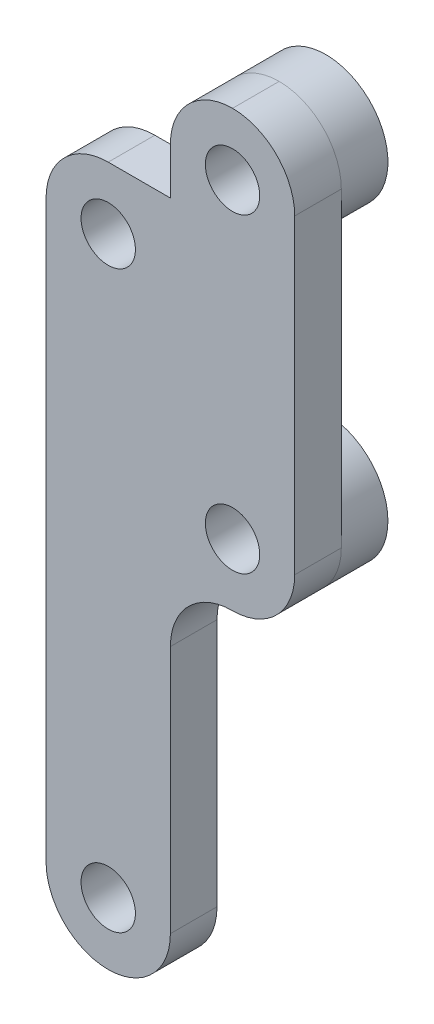
ISO-10303-21;
HEADER;
FILE_DESCRIPTION(('STEP AP214'),'2;1');
FILE_NAME('part.step','',(''),(''),'','','');
FILE_SCHEMA(('AUTOMOTIVE_DESIGN { 1 0 10303 214 1 1 1 1 }'));
ENDSEC;
DATA;
#1=APPLICATION_CONTEXT('core data for automotive mechanical design processes');
#2=APPLICATION_PROTOCOL_DEFINITION('international standard','automotive_design',2000,#1);
#3=PRODUCT_CONTEXT('',#1,'mechanical');
#4=PRODUCT('Part','Part','',(#3));
#5=PRODUCT_RELATED_PRODUCT_CATEGORY('part','',(#4));
#6=PRODUCT_DEFINITION_FORMATION('','',#4);
#7=PRODUCT_DEFINITION_CONTEXT('part definition',#1,'design');
#8=PRODUCT_DEFINITION('design','',#6,#7);
#9=PRODUCT_DEFINITION_SHAPE('','',#8);
#10=(LENGTH_UNIT() NAMED_UNIT(*) SI_UNIT(.MILLI.,.METRE.));
#11=(NAMED_UNIT(*) PLANE_ANGLE_UNIT() SI_UNIT($,.RADIAN.));
#12=(NAMED_UNIT(*) SI_UNIT($,.STERADIAN.) SOLID_ANGLE_UNIT());
#13=UNCERTAINTY_MEASURE_WITH_UNIT(LENGTH_MEASURE(1.E-05),#10,'distance_accuracy_value','');
#14=(GEOMETRIC_REPRESENTATION_CONTEXT(3) GLOBAL_UNCERTAINTY_ASSIGNED_CONTEXT((#13)) GLOBAL_UNIT_ASSIGNED_CONTEXT((#10,
#11,#12)) REPRESENTATION_CONTEXT('',''));
#15=CARTESIAN_POINT('',(0.,0.,0.));
#16=DIRECTION('',(0.,0.,1.));
#17=DIRECTION('',(1.,0.,0.));
#18=AXIS2_PLACEMENT_3D('',#15,#16,#17);
#19=CARTESIAN_POINT('',(0.,0.,0.));
#20=DIRECTION('',(0.,0.,-1.));
#21=DIRECTION('',(-1.,0.,0.));
#22=AXIS2_PLACEMENT_3D('',#19,#20,#21);
#23=PLANE('',#22);
#24=CARTESIAN_POINT('',(-8.,13.,0.));
#25=DIRECTION('',(0.,0.,1.));
#26=DIRECTION('',(1.,0.,0.));
#27=AXIS2_PLACEMENT_3D('',#24,#25,#26);
#28=CIRCLE('',#27,1.75);
#29=CARTESIAN_POINT('',(-6.25,13.,0.));
#30=VERTEX_POINT('',#29);
#31=EDGE_CURVE('E179',#30,#30,#28,.T.);
#32=ORIENTED_EDGE('',*,*,#31,.T.);
#33=EDGE_LOOP('',(#32));
#34=FACE_BOUND('',#33,.T.);
#35=CARTESIAN_POINT('',(-8.,-24.,0.));
#36=DIRECTION('',(0.,0.,1.));
#37=DIRECTION('',(1.,0.,0.));
#38=AXIS2_PLACEMENT_3D('',#35,#36,#37);
#39=CIRCLE('',#38,1.75);
#40=CARTESIAN_POINT('',(-6.25,-24.,0.));
#41=VERTEX_POINT('',#40);
#42=EDGE_CURVE('E183',#41,#41,#39,.T.);
#43=ORIENTED_EDGE('',*,*,#42,.T.);
#44=EDGE_LOOP('',(#43));
#45=FACE_BOUND('',#44,.T.);
#46=CARTESIAN_POINT('',(-8.,-24.,0.));
#47=DIRECTION('',(0.,0.,-1.));
#48=DIRECTION('',(-1.,0.,0.));
#49=AXIS2_PLACEMENT_3D('',#46,#47,#48);
#50=CIRCLE('',#49,4.);
#51=CARTESIAN_POINT('',(-4.,-24.,0.));
#52=VERTEX_POINT('',#51);
#53=CARTESIAN_POINT('',(-8.,-28.,0.));
#54=VERTEX_POINT('',#53);
#55=EDGE_CURVE('E215',#52,#54,#50,.T.);
#56=ORIENTED_EDGE('',*,*,#55,.T.);
#57=CARTESIAN_POINT('',(-8.,-24.,0.));
#58=DIRECTION('',(0.,0.,-1.));
#59=DIRECTION('',(-1.,0.,0.));
#60=AXIS2_PLACEMENT_3D('',#57,#58,#59);
#61=CIRCLE('',#60,4.);
#62=CARTESIAN_POINT('',(-12.,-24.,0.));
#63=VERTEX_POINT('',#62);
#64=EDGE_CURVE('E217',#54,#63,#61,.T.);
#65=ORIENTED_EDGE('',*,*,#64,.T.);
#66=DIRECTION('',(0.,-1.,0.));
#67=VECTOR('',#66,1.);
#68=CARTESIAN_POINT('',(-12.,-28.,0.));
#69=LINE('',#68,#67);
#70=CARTESIAN_POINT('',(-12.,13.,0.));
#71=VERTEX_POINT('',#70);
#72=EDGE_CURVE('E194',#71,#63,#69,.T.);
#73=ORIENTED_EDGE('',*,*,#72,.F.);
#74=CARTESIAN_POINT('',(-8.,13.,0.));
#75=DIRECTION('',(0.,0.,-1.));
#76=DIRECTION('',(-1.,0.,0.));
#77=AXIS2_PLACEMENT_3D('',#74,#75,#76);
#78=CIRCLE('',#77,4.);
#79=CARTESIAN_POINT('',(-8.,17.,0.));
#80=VERTEX_POINT('',#79);
#81=EDGE_CURVE('E213',#71,#80,#78,.T.);
#82=ORIENTED_EDGE('',*,*,#81,.T.);
#83=DIRECTION('',(-1.,0.,0.));
#84=VECTOR('',#83,1.);
#85=CARTESIAN_POINT('',(-12.,17.,0.));
#86=LINE('',#85,#84);
#87=CARTESIAN_POINT('',(-4.,17.,0.));
#88=VERTEX_POINT('',#87);
#89=EDGE_CURVE('E207',#88,#80,#86,.T.);
#90=ORIENTED_EDGE('',*,*,#89,.F.);
#91=DIRECTION('',(0.,-1.,0.));
#92=VECTOR('',#91,1.);
#93=CARTESIAN_POINT('',(-4.,24.,0.));
#94=LINE('',#93,#92);
#95=CARTESIAN_POINT('',(-4.,20.,0.));
#96=VERTEX_POINT('',#95);
#97=EDGE_CURVE('E152',#96,#88,#94,.T.);
#98=ORIENTED_EDGE('',*,*,#97,.F.);
#99=CARTESIAN_POINT('',(0.,20.,0.));
#100=DIRECTION('',(0.,0.,-1.));
#101=DIRECTION('',(-1.,0.,0.));
#102=AXIS2_PLACEMENT_3D('',#99,#100,#101);
#103=CIRCLE('',#102,4.);
#104=CARTESIAN_POINT('',(4.,20.,0.));
#105=VERTEX_POINT('',#104);
#106=EDGE_CURVE('E150',#105,#96,#103,.T.);
#107=ORIENTED_EDGE('',*,*,#106,.F.);
#108=DIRECTION('',(0.,1.,0.));
#109=VECTOR('',#108,1.);
#110=CARTESIAN_POINT('',(4.,24.,0.));
#111=LINE('',#110,#109);
#112=CARTESIAN_POINT('',(4.,0.,0.));
#113=VERTEX_POINT('',#112);
#114=EDGE_CURVE('E130',#113,#105,#111,.T.);
#115=ORIENTED_EDGE('',*,*,#114,.F.);
#116=CARTESIAN_POINT('',(0.,0.,0.));
#117=DIRECTION('',(0.,0.,-1.));
#118=DIRECTION('',(-1.,0.,0.));
#119=AXIS2_PLACEMENT_3D('',#116,#117,#118);
#120=CIRCLE('',#119,4.);
#121=CARTESIAN_POINT('',(0.,-4.,0.));
#122=VERTEX_POINT('',#121);
#123=EDGE_CURVE('E141',#122,#113,#120,.T.);
#124=ORIENTED_EDGE('',*,*,#123,.F.);
#125=CARTESIAN_POINT('',(0.,-8.,0.));
#126=DIRECTION('',(0.,0.,-1.));
#127=DIRECTION('',(-1.,0.,0.));
#128=AXIS2_PLACEMENT_3D('',#125,#126,#127);
#129=CIRCLE('',#128,4.);
#130=CARTESIAN_POINT('',(-4.,-8.,0.));
#131=VERTEX_POINT('',#130);
#132=EDGE_CURVE('E42',#122,#131,#129,.F.);
#133=ORIENTED_EDGE('',*,*,#132,.T.);
#134=DIRECTION('',(0.,1.,0.));
#135=VECTOR('',#134,1.);
#136=CARTESIAN_POINT('',(-4.,-28.,0.));
#137=LINE('',#136,#135);
#138=EDGE_CURVE('E153',#52,#131,#137,.T.);
#139=ORIENTED_EDGE('',*,*,#138,.F.);
#140=EDGE_LOOP('',(#56,#65,#73,#82,#90,#98,#107,#115,#124,#133,#139));
#141=FACE_BOUND('',#140,.T.);
#142=ADVANCED_FACE('F33',(#34,#45,#141),#23,.T.);
#143=CARTESIAN_POINT('',(0.,0.,3.));
#144=DIRECTION('',(0.,0.,-1.));
#145=DIRECTION('',(-1.,0.,0.));
#146=AXIS2_PLACEMENT_3D('',#143,#144,#145);
#147=PLANE('',#146);
#148=DIRECTION('',(0.,-1.,0.));
#149=VECTOR('',#148,1.);
#150=CARTESIAN_POINT('',(-12.,-28.,3.));
#151=LINE('',#150,#149);
#152=CARTESIAN_POINT('',(-12.,13.,3.));
#153=VERTEX_POINT('',#152);
#154=CARTESIAN_POINT('',(-12.,-24.,3.));
#155=VERTEX_POINT('',#154);
#156=EDGE_CURVE('E200',#153,#155,#151,.T.);
#157=ORIENTED_EDGE('',*,*,#156,.T.);
#158=CARTESIAN_POINT('',(-8.,-24.,3.));
#159=DIRECTION('',(0.,0.,-1.));
#160=DIRECTION('',(-1.,0.,0.));
#161=AXIS2_PLACEMENT_3D('',#158,#159,#160);
#162=CIRCLE('',#161,4.);
#163=CARTESIAN_POINT('',(-8.,-28.,3.));
#164=VERTEX_POINT('',#163);
#165=EDGE_CURVE('E234',#155,#164,#162,.F.);
#166=ORIENTED_EDGE('',*,*,#165,.T.);
#167=CARTESIAN_POINT('',(-8.,-24.,3.));
#168=DIRECTION('',(0.,0.,-1.));
#169=DIRECTION('',(-1.,0.,0.));
#170=AXIS2_PLACEMENT_3D('',#167,#168,#169);
#171=CIRCLE('',#170,4.);
#172=CARTESIAN_POINT('',(-4.,-24.,3.));
#173=VERTEX_POINT('',#172);
#174=EDGE_CURVE('E232',#164,#173,#171,.F.);
#175=ORIENTED_EDGE('',*,*,#174,.T.);
#176=DIRECTION('',(0.,1.,0.));
#177=VECTOR('',#176,1.);
#178=CARTESIAN_POINT('',(-4.,-28.,3.));
#179=LINE('',#178,#177);
#180=CARTESIAN_POINT('',(-4.,-8.,3.));
#181=VERTEX_POINT('',#180);
#182=EDGE_CURVE('E191',#173,#181,#179,.T.);
#183=ORIENTED_EDGE('',*,*,#182,.T.);
#184=CARTESIAN_POINT('',(0.,-8.,3.));
#185=DIRECTION('',(0.,0.,-1.));
#186=DIRECTION('',(-1.,0.,0.));
#187=AXIS2_PLACEMENT_3D('',#184,#185,#186);
#188=CIRCLE('',#187,4.);
#189=CARTESIAN_POINT('',(0.,-4.,3.));
#190=VERTEX_POINT('',#189);
#191=EDGE_CURVE('E11',#181,#190,#188,.T.);
#192=ORIENTED_EDGE('',*,*,#191,.T.);
#193=CARTESIAN_POINT('',(0.,0.,3.));
#194=DIRECTION('',(0.,0.,-1.));
#195=DIRECTION('',(-1.,0.,0.));
#196=AXIS2_PLACEMENT_3D('',#193,#194,#195);
#197=CIRCLE('',#196,4.);
#198=CARTESIAN_POINT('',(4.,0.,3.));
#199=VERTEX_POINT('',#198);
#200=EDGE_CURVE('E230',#190,#199,#197,.F.);
#201=ORIENTED_EDGE('',*,*,#200,.T.);
#202=DIRECTION('',(0.,1.,0.));
#203=VECTOR('',#202,1.);
#204=CARTESIAN_POINT('',(4.,24.,3.));
#205=LINE('',#204,#203);
#206=CARTESIAN_POINT('',(4.,20.,3.));
#207=VERTEX_POINT('',#206);
#208=EDGE_CURVE('E133',#199,#207,#205,.T.);
#209=ORIENTED_EDGE('',*,*,#208,.T.);
#210=CARTESIAN_POINT('',(0.,20.,3.));
#211=DIRECTION('',(0.,0.,-1.));
#212=DIRECTION('',(-1.,0.,0.));
#213=AXIS2_PLACEMENT_3D('',#210,#211,#212);
#214=CIRCLE('',#213,4.);
#215=CARTESIAN_POINT('',(0.,24.,3.));
#216=VERTEX_POINT('',#215);
#217=EDGE_CURVE('E226',#207,#216,#214,.F.);
#218=ORIENTED_EDGE('',*,*,#217,.T.);
#219=CARTESIAN_POINT('',(0.,20.,3.));
#220=DIRECTION('',(0.,0.,-1.));
#221=DIRECTION('',(-1.,0.,0.));
#222=AXIS2_PLACEMENT_3D('',#219,#220,#221);
#223=CIRCLE('',#222,4.);
#224=CARTESIAN_POINT('',(-4.,20.,3.));
#225=VERTEX_POINT('',#224);
#226=EDGE_CURVE('E58',#216,#225,#223,.F.);
#227=ORIENTED_EDGE('',*,*,#226,.T.);
#228=DIRECTION('',(0.,-1.,0.));
#229=VECTOR('',#228,1.);
#230=CARTESIAN_POINT('',(-4.,24.,3.));
#231=LINE('',#230,#229);
#232=CARTESIAN_POINT('',(-4.,17.,3.));
#233=VERTEX_POINT('',#232);
#234=EDGE_CURVE('E196',#225,#233,#231,.T.);
#235=ORIENTED_EDGE('',*,*,#234,.T.);
#236=DIRECTION('',(-1.,0.,0.));
#237=VECTOR('',#236,1.);
#238=CARTESIAN_POINT('',(-12.,17.,3.));
#239=LINE('',#238,#237);
#240=CARTESIAN_POINT('',(-8.,17.,3.));
#241=VERTEX_POINT('',#240);
#242=EDGE_CURVE('E198',#233,#241,#239,.T.);
#243=ORIENTED_EDGE('',*,*,#242,.T.);
#244=CARTESIAN_POINT('',(-8.,13.,3.));
#245=DIRECTION('',(0.,0.,-1.));
#246=DIRECTION('',(-1.,0.,0.));
#247=AXIS2_PLACEMENT_3D('',#244,#245,#246);
#248=CIRCLE('',#247,4.);
#249=EDGE_CURVE('E228',#241,#153,#248,.F.);
#250=ORIENTED_EDGE('',*,*,#249,.T.);
#251=EDGE_LOOP('',(#157,#166,#175,#183,#192,#201,#209,#218,#227,#235,#243,#250));
#252=FACE_BOUND('',#251,.T.);
#253=CARTESIAN_POINT('',(-8.,-24.,3.));
#254=DIRECTION('',(0.,0.,1.));
#255=DIRECTION('',(1.,0.,0.));
#256=AXIS2_PLACEMENT_3D('',#253,#254,#255);
#257=CIRCLE('',#256,1.75);
#258=CARTESIAN_POINT('',(-6.25,-24.,3.));
#259=VERTEX_POINT('',#258);
#260=EDGE_CURVE('E186',#259,#259,#257,.T.);
#261=ORIENTED_EDGE('',*,*,#260,.F.);
#262=EDGE_LOOP('',(#261));
#263=FACE_BOUND('',#262,.T.);
#264=CARTESIAN_POINT('',(-8.,13.,3.));
#265=DIRECTION('',(0.,0.,1.));
#266=DIRECTION('',(1.,0.,0.));
#267=AXIS2_PLACEMENT_3D('',#264,#265,#266);
#268=CIRCLE('',#267,1.75);
#269=CARTESIAN_POINT('',(-6.25,13.,3.));
#270=VERTEX_POINT('',#269);
#271=EDGE_CURVE('E180',#270,#270,#268,.T.);
#272=ORIENTED_EDGE('',*,*,#271,.F.);
#273=EDGE_LOOP('',(#272));
#274=FACE_BOUND('',#273,.T.);
#275=CARTESIAN_POINT('',(0.,20.,3.));
#276=DIRECTION('',(0.,0.,1.));
#277=DIRECTION('',(1.,0.,0.));
#278=AXIS2_PLACEMENT_3D('',#275,#276,#277);
#279=CIRCLE('',#278,1.75);
#280=CARTESIAN_POINT('',(1.75,20.,3.));
#281=VERTEX_POINT('',#280);
#282=EDGE_CURVE('E176',#281,#281,#279,.T.);
#283=ORIENTED_EDGE('',*,*,#282,.F.);
#284=EDGE_LOOP('',(#283));
#285=FACE_BOUND('',#284,.T.);
#286=CARTESIAN_POINT('',(0.,0.,3.));
#287=DIRECTION('',(0.,0.,1.));
#288=DIRECTION('',(1.,0.,0.));
#289=AXIS2_PLACEMENT_3D('',#286,#287,#288);
#290=CIRCLE('',#289,1.75);
#291=CARTESIAN_POINT('',(1.75,0.,3.));
#292=VERTEX_POINT('',#291);
#293=EDGE_CURVE('E171',#292,#292,#290,.T.);
#294=ORIENTED_EDGE('',*,*,#293,.F.);
#295=EDGE_LOOP('',(#294));
#296=FACE_BOUND('',#295,.T.);
#297=ADVANCED_FACE('F264',(#252,#263,#274,#285,#296),#147,.F.);
#298=CARTESIAN_POINT('',(-4.,-28.,3.));
#299=DIRECTION('',(-1.,0.,0.));
#300=DIRECTION('',(0.,0.,1.));
#301=AXIS2_PLACEMENT_3D('',#298,#299,#300);
#302=PLANE('',#301);
#303=ORIENTED_EDGE('',*,*,#182,.F.);
#304=DIRECTION('',(0.,0.,-1.));
#305=VECTOR('',#304,1.);
#306=CARTESIAN_POINT('',(-4.,-24.,3.));
#307=LINE('',#306,#305);
#308=EDGE_CURVE('E239',#173,#52,#307,.T.);
#309=ORIENTED_EDGE('',*,*,#308,.T.);
#310=ORIENTED_EDGE('',*,*,#138,.T.);
#311=DIRECTION('',(0.,0.,-1.));
#312=VECTOR('',#311,1.);
#313=CARTESIAN_POINT('',(-4.,-8.,3.));
#314=LINE('',#313,#312);
#315=EDGE_CURVE('E236',#131,#181,#314,.F.);
#316=ORIENTED_EDGE('',*,*,#315,.T.);
#317=EDGE_LOOP('',(#303,#309,#310,#316));
#318=FACE_BOUND('',#317,.T.);
#319=ADVANCED_FACE('F270',(#318),#302,.F.);
#320=CARTESIAN_POINT('',(4.,24.,3.));
#321=DIRECTION('',(-1.,0.,0.));
#322=DIRECTION('',(0.,-1.,0.));
#323=AXIS2_PLACEMENT_3D('',#320,#321,#322);
#324=PLANE('',#323);
#325=ORIENTED_EDGE('',*,*,#208,.F.);
#326=DIRECTION('',(0.,0.,-1.));
#327=VECTOR('',#326,1.);
#328=CARTESIAN_POINT('',(4.,0.,3.));
#329=LINE('',#328,#327);
#330=EDGE_CURVE('E125',#199,#113,#329,.T.);
#331=ORIENTED_EDGE('',*,*,#330,.T.);
#332=ORIENTED_EDGE('',*,*,#114,.T.);
#333=DIRECTION('',(0.,0.,-1.));
#334=VECTOR('',#333,1.);
#335=CARTESIAN_POINT('',(4.,20.,3.));
#336=LINE('',#335,#334);
#337=EDGE_CURVE('E137',#105,#207,#336,.F.);
#338=ORIENTED_EDGE('',*,*,#337,.T.);
#339=EDGE_LOOP('',(#325,#331,#332,#338));
#340=FACE_BOUND('',#339,.T.);
#341=ADVANCED_FACE('F127',(#340),#324,.F.);
#342=CARTESIAN_POINT('',(-4.,24.,3.));
#343=DIRECTION('',(1.,0.,0.));
#344=DIRECTION('',(0.,0.,-1.));
#345=AXIS2_PLACEMENT_3D('',#342,#343,#344);
#346=PLANE('',#345);
#347=ORIENTED_EDGE('',*,*,#234,.F.);
#348=DIRECTION('',(0.,0.,-1.));
#349=VECTOR('',#348,1.);
#350=CARTESIAN_POINT('',(-4.,20.,3.));
#351=LINE('',#350,#349);
#352=EDGE_CURVE('E243',#225,#96,#351,.T.);
#353=ORIENTED_EDGE('',*,*,#352,.T.);
#354=ORIENTED_EDGE('',*,*,#97,.T.);
#355=DIRECTION('',(0.,0.,-1.));
#356=VECTOR('',#355,1.);
#357=CARTESIAN_POINT('',(-4.,17.,3.));
#358=LINE('',#357,#356);
#359=EDGE_CURVE('E203',#233,#88,#358,.T.);
#360=ORIENTED_EDGE('',*,*,#359,.F.);
#361=EDGE_LOOP('',(#347,#353,#354,#360));
#362=FACE_BOUND('',#361,.T.);
#363=ADVANCED_FACE('F259',(#362),#346,.F.);
#364=CARTESIAN_POINT('',(-12.,17.,3.));
#365=DIRECTION('',(0.,-1.,0.));
#366=DIRECTION('',(0.,0.,-1.));
#367=AXIS2_PLACEMENT_3D('',#364,#365,#366);
#368=PLANE('',#367);
#369=ORIENTED_EDGE('',*,*,#89,.T.);
#370=DIRECTION('',(0.,0.,-1.));
#371=VECTOR('',#370,1.);
#372=CARTESIAN_POINT('',(-8.,17.,3.));
#373=LINE('',#372,#371);
#374=EDGE_CURVE('E50',#80,#241,#373,.F.);
#375=ORIENTED_EDGE('',*,*,#374,.T.);
#376=ORIENTED_EDGE('',*,*,#242,.F.);
#377=ORIENTED_EDGE('',*,*,#359,.T.);
#378=EDGE_LOOP('',(#369,#375,#376,#377));
#379=FACE_BOUND('',#378,.T.);
#380=ADVANCED_FACE('F290',(#379),#368,.F.);
#381=CARTESIAN_POINT('',(-12.,-28.,3.));
#382=DIRECTION('',(1.,0.,0.));
#383=DIRECTION('',(0.,0.,-1.));
#384=AXIS2_PLACEMENT_3D('',#381,#382,#383);
#385=PLANE('',#384);
#386=ORIENTED_EDGE('',*,*,#72,.T.);
#387=DIRECTION('',(0.,0.,-1.));
#388=VECTOR('',#387,1.);
#389=CARTESIAN_POINT('',(-12.,-24.,3.));
#390=LINE('',#389,#388);
#391=EDGE_CURVE('E222',#63,#155,#390,.F.);
#392=ORIENTED_EDGE('',*,*,#391,.T.);
#393=ORIENTED_EDGE('',*,*,#156,.F.);
#394=DIRECTION('',(0.,0.,-1.));
#395=VECTOR('',#394,1.);
#396=CARTESIAN_POINT('',(-12.,13.,3.));
#397=LINE('',#396,#395);
#398=EDGE_CURVE('E219',#153,#71,#397,.T.);
#399=ORIENTED_EDGE('',*,*,#398,.T.);
#400=EDGE_LOOP('',(#386,#392,#393,#399));
#401=FACE_BOUND('',#400,.T.);
#402=ADVANCED_FACE('F284',(#401),#385,.F.);
#403=CARTESIAN_POINT('',(-8.,-24.,3.));
#404=DIRECTION('',(0.,0.,-1.));
#405=DIRECTION('',(-1.,0.,0.));
#406=AXIS2_PLACEMENT_3D('',#403,#404,#405);
#407=CYLINDRICAL_SURFACE('',#406,1.75);
#408=ORIENTED_EDGE('',*,*,#260,.T.);
#409=EDGE_LOOP('',(#408));
#410=FACE_BOUND('',#409,.T.);
#411=ORIENTED_EDGE('',*,*,#42,.F.);
#412=EDGE_LOOP('',(#411));
#413=FACE_BOUND('',#412,.T.);
#414=ADVANCED_FACE('F297',(#410,#413),#407,.F.);
#415=CARTESIAN_POINT('',(-8.,13.,3.));
#416=DIRECTION('',(0.,0.,-1.));
#417=DIRECTION('',(-1.,0.,0.));
#418=AXIS2_PLACEMENT_3D('',#415,#416,#417);
#419=CYLINDRICAL_SURFACE('',#418,1.75);
#420=ORIENTED_EDGE('',*,*,#271,.T.);
#421=EDGE_LOOP('',(#420));
#422=FACE_BOUND('',#421,.T.);
#423=ORIENTED_EDGE('',*,*,#31,.F.);
#424=EDGE_LOOP('',(#423));
#425=FACE_BOUND('',#424,.T.);
#426=ADVANCED_FACE('F311',(#422,#425),#419,.F.);
#427=CARTESIAN_POINT('',(0.,20.,3.));
#428=DIRECTION('',(0.,0.,-1.));
#429=DIRECTION('',(-1.,0.,0.));
#430=AXIS2_PLACEMENT_3D('',#427,#428,#429);
#431=CYLINDRICAL_SURFACE('',#430,1.75);
#432=ORIENTED_EDGE('',*,*,#282,.T.);
#433=EDGE_LOOP('',(#432));
#434=FACE_BOUND('',#433,.T.);
#435=CARTESIAN_POINT('',(0.,20.,-3.));
#436=DIRECTION('',(0.,0.,-1.));
#437=DIRECTION('',(-1.,0.,0.));
#438=AXIS2_PLACEMENT_3D('',#435,#436,#437);
#439=CIRCLE('',#438,1.75);
#440=CARTESIAN_POINT('',(-1.75,20.,-3.));
#441=VERTEX_POINT('',#440);
#442=EDGE_CURVE('E161',#441,#441,#439,.T.);
#443=ORIENTED_EDGE('',*,*,#442,.T.);
#444=EDGE_LOOP('',(#443));
#445=FACE_BOUND('',#444,.T.);
#446=ADVANCED_FACE('F315',(#434,#445),#431,.F.);
#447=CARTESIAN_POINT('',(0.,0.,3.));
#448=DIRECTION('',(0.,0.,-1.));
#449=DIRECTION('',(-1.,0.,0.));
#450=AXIS2_PLACEMENT_3D('',#447,#448,#449);
#451=CYLINDRICAL_SURFACE('',#450,1.75);
#452=ORIENTED_EDGE('',*,*,#293,.T.);
#453=EDGE_LOOP('',(#452));
#454=FACE_BOUND('',#453,.T.);
#455=CARTESIAN_POINT('',(0.,0.,-3.));
#456=DIRECTION('',(0.,0.,-1.));
#457=DIRECTION('',(-1.,0.,0.));
#458=AXIS2_PLACEMENT_3D('',#455,#456,#457);
#459=CIRCLE('',#458,1.75);
#460=CARTESIAN_POINT('',(-1.75,0.,-3.));
#461=VERTEX_POINT('',#460);
#462=EDGE_CURVE('E146',#461,#461,#459,.T.);
#463=ORIENTED_EDGE('',*,*,#462,.T.);
#464=EDGE_LOOP('',(#463));
#465=FACE_BOUND('',#464,.T.);
#466=ADVANCED_FACE('F319',(#454,#465),#451,.F.);
#467=CARTESIAN_POINT('',(0.,20.,-3.));
#468=DIRECTION('',(0.,0.,-1.));
#469=DIRECTION('',(-1.,0.,0.));
#470=AXIS2_PLACEMENT_3D('',#467,#468,#469);
#471=PLANE('',#470);
#472=CARTESIAN_POINT('',(0.,20.,-3.));
#473=DIRECTION('',(0.,0.,-1.));
#474=DIRECTION('',(-1.,0.,0.));
#475=AXIS2_PLACEMENT_3D('',#472,#473,#474);
#476=CIRCLE('',#475,4.);
#477=CARTESIAN_POINT('',(-4.,20.,-3.));
#478=VERTEX_POINT('',#477);
#479=EDGE_CURVE('E168',#478,#478,#476,.T.);
#480=ORIENTED_EDGE('',*,*,#479,.T.);
#481=EDGE_LOOP('',(#480));
#482=FACE_BOUND('',#481,.T.);
#483=ORIENTED_EDGE('',*,*,#442,.F.);
#484=EDGE_LOOP('',(#483));
#485=FACE_BOUND('',#484,.T.);
#486=ADVANCED_FACE('F323',(#482,#485),#471,.T.);
#487=CARTESIAN_POINT('',(0.,20.,-3.));
#488=DIRECTION('',(0.,0.,1.));
#489=DIRECTION('',(1.,0.,0.));
#490=AXIS2_PLACEMENT_3D('',#487,#488,#489);
#491=CYLINDRICAL_SURFACE('',#490,4.);
#492=ORIENTED_EDGE('',*,*,#479,.F.);
#493=EDGE_LOOP('',(#492));
#494=FACE_BOUND('',#493,.T.);
#495=CARTESIAN_POINT('',(0.,24.,0.));
#496=VERTEX_POINT('',#495);
#497=EDGE_CURVE('E167',#96,#496,#103,.T.);
#498=ORIENTED_EDGE('',*,*,#497,.T.);
#499=EDGE_CURVE('E173',#496,#105,#103,.T.);
#500=ORIENTED_EDGE('',*,*,#499,.T.);
#501=ORIENTED_EDGE('',*,*,#106,.T.);
#502=EDGE_LOOP('',(#498,#500,#501));
#503=FACE_BOUND('',#502,.T.);
#504=ADVANCED_FACE('F263',(#494,#503),#491,.T.);
#505=CARTESIAN_POINT('',(0.,0.,-3.));
#506=DIRECTION('',(0.,0.,-1.));
#507=DIRECTION('',(-1.,0.,0.));
#508=AXIS2_PLACEMENT_3D('',#505,#506,#507);
#509=PLANE('',#508);
#510=CARTESIAN_POINT('',(0.,0.,-3.));
#511=DIRECTION('',(0.,0.,-1.));
#512=DIRECTION('',(-1.,0.,0.));
#513=AXIS2_PLACEMENT_3D('',#510,#511,#512);
#514=CIRCLE('',#513,4.);
#515=CARTESIAN_POINT('',(-4.,0.,-3.));
#516=VERTEX_POINT('',#515);
#517=EDGE_CURVE('E159',#516,#516,#514,.T.);
#518=ORIENTED_EDGE('',*,*,#517,.T.);
#519=EDGE_LOOP('',(#518));
#520=FACE_BOUND('',#519,.T.);
#521=ORIENTED_EDGE('',*,*,#462,.F.);
#522=EDGE_LOOP('',(#521));
#523=FACE_BOUND('',#522,.T.);
#524=ADVANCED_FACE('F327',(#520,#523),#509,.T.);
#525=CARTESIAN_POINT('',(0.,0.,-3.));
#526=DIRECTION('',(0.,0.,1.));
#527=DIRECTION('',(1.,0.,0.));
#528=AXIS2_PLACEMENT_3D('',#525,#526,#527);
#529=CYLINDRICAL_SURFACE('',#528,4.);
#530=ORIENTED_EDGE('',*,*,#517,.F.);
#531=EDGE_LOOP('',(#530));
#532=FACE_BOUND('',#531,.T.);
#533=EDGE_CURVE('E143',#113,#122,#120,.T.);
#534=ORIENTED_EDGE('',*,*,#533,.T.);
#535=ORIENTED_EDGE('',*,*,#123,.T.);
#536=EDGE_LOOP('',(#534,#535));
#537=FACE_BOUND('',#536,.T.);
#538=ADVANCED_FACE('F142',(#532,#537),#529,.T.);
#539=CARTESIAN_POINT('',(-8.,-24.,3.));
#540=DIRECTION('',(0.,0.,-1.));
#541=DIRECTION('',(-1.,0.,0.));
#542=AXIS2_PLACEMENT_3D('',#539,#540,#541);
#543=CYLINDRICAL_SURFACE('',#542,4.);
#544=ORIENTED_EDGE('',*,*,#308,.F.);
#545=ORIENTED_EDGE('',*,*,#174,.F.);
#546=DIRECTION('',(0.,0.,-1.));
#547=VECTOR('',#546,1.);
#548=CARTESIAN_POINT('',(-8.,-28.,3.));
#549=LINE('',#548,#547);
#550=EDGE_CURVE('E246',#54,#164,#549,.F.);
#551=ORIENTED_EDGE('',*,*,#550,.F.);
#552=ORIENTED_EDGE('',*,*,#55,.F.);
#553=EDGE_LOOP('',(#544,#545,#551,#552));
#554=FACE_BOUND('',#553,.T.);
#555=ADVANCED_FACE('F276',(#554),#543,.T.);
#556=CARTESIAN_POINT('',(-8.,-24.,3.));
#557=DIRECTION('',(0.,0.,-1.));
#558=DIRECTION('',(-1.,0.,0.));
#559=AXIS2_PLACEMENT_3D('',#556,#557,#558);
#560=CYLINDRICAL_SURFACE('',#559,4.);
#561=ORIENTED_EDGE('',*,*,#165,.F.);
#562=ORIENTED_EDGE('',*,*,#391,.F.);
#563=ORIENTED_EDGE('',*,*,#64,.F.);
#564=ORIENTED_EDGE('',*,*,#550,.T.);
#565=EDGE_LOOP('',(#561,#562,#563,#564));
#566=FACE_BOUND('',#565,.T.);
#567=ADVANCED_FACE('F281',(#566),#560,.T.);
#568=CARTESIAN_POINT('',(0.,0.,3.));
#569=DIRECTION('',(0.,0.,-1.));
#570=DIRECTION('',(-1.,0.,0.));
#571=AXIS2_PLACEMENT_3D('',#568,#569,#570);
#572=CYLINDRICAL_SURFACE('',#571,4.);
#573=ORIENTED_EDGE('',*,*,#330,.F.);
#574=ORIENTED_EDGE('',*,*,#200,.F.);
#575=DIRECTION('',(0.,0.,-1.));
#576=VECTOR('',#575,1.);
#577=CARTESIAN_POINT('',(0.,-4.,3.));
#578=LINE('',#577,#576);
#579=EDGE_CURVE('E157',#122,#190,#578,.F.);
#580=ORIENTED_EDGE('',*,*,#579,.F.);
#581=ORIENTED_EDGE('',*,*,#533,.F.);
#582=EDGE_LOOP('',(#573,#574,#580,#581));
#583=FACE_BOUND('',#582,.T.);
#584=ADVANCED_FACE('F155',(#583),#572,.T.);
#585=CARTESIAN_POINT('',(0.,-8.,3.));
#586=DIRECTION('',(0.,0.,1.));
#587=DIRECTION('',(1.,0.,0.));
#588=AXIS2_PLACEMENT_3D('',#585,#586,#587);
#589=CYLINDRICAL_SURFACE('',#588,4.);
#590=ORIENTED_EDGE('',*,*,#191,.F.);
#591=ORIENTED_EDGE('',*,*,#315,.F.);
#592=ORIENTED_EDGE('',*,*,#132,.F.);
#593=ORIENTED_EDGE('',*,*,#579,.T.);
#594=EDGE_LOOP('',(#590,#591,#592,#593));
#595=FACE_BOUND('',#594,.T.);
#596=ADVANCED_FACE('F268',(#595),#589,.F.);
#597=CARTESIAN_POINT('',(-8.,13.,3.));
#598=DIRECTION('',(0.,0.,-1.));
#599=DIRECTION('',(-1.,0.,0.));
#600=AXIS2_PLACEMENT_3D('',#597,#598,#599);
#601=CYLINDRICAL_SURFACE('',#600,4.);
#602=ORIENTED_EDGE('',*,*,#249,.F.);
#603=ORIENTED_EDGE('',*,*,#374,.F.);
#604=ORIENTED_EDGE('',*,*,#81,.F.);
#605=ORIENTED_EDGE('',*,*,#398,.F.);
#606=EDGE_LOOP('',(#602,#603,#604,#605));
#607=FACE_BOUND('',#606,.T.);
#608=ADVANCED_FACE('F289',(#607),#601,.T.);
#609=CARTESIAN_POINT('',(0.,20.,3.));
#610=DIRECTION('',(0.,0.,-1.));
#611=DIRECTION('',(-1.,0.,0.));
#612=AXIS2_PLACEMENT_3D('',#609,#610,#611);
#613=CYLINDRICAL_SURFACE('',#612,4.);
#614=ORIENTED_EDGE('',*,*,#352,.F.);
#615=ORIENTED_EDGE('',*,*,#226,.F.);
#616=DIRECTION('',(0.,0.,-1.));
#617=VECTOR('',#616,1.);
#618=CARTESIAN_POINT('',(0.,24.,3.));
#619=LINE('',#618,#617);
#620=EDGE_CURVE('E37',#496,#216,#619,.F.);
#621=ORIENTED_EDGE('',*,*,#620,.F.);
#622=ORIENTED_EDGE('',*,*,#497,.F.);
#623=EDGE_LOOP('',(#614,#615,#621,#622));
#624=FACE_BOUND('',#623,.T.);
#625=ADVANCED_FACE('F35',(#624),#613,.T.);
#626=CARTESIAN_POINT('',(0.,20.,3.));
#627=DIRECTION('',(0.,0.,-1.));
#628=DIRECTION('',(-1.,0.,0.));
#629=AXIS2_PLACEMENT_3D('',#626,#627,#628);
#630=CYLINDRICAL_SURFACE('',#629,4.);
#631=ORIENTED_EDGE('',*,*,#217,.F.);
#632=ORIENTED_EDGE('',*,*,#337,.F.);
#633=ORIENTED_EDGE('',*,*,#499,.F.);
#634=ORIENTED_EDGE('',*,*,#620,.T.);
#635=EDGE_LOOP('',(#631,#632,#633,#634));
#636=FACE_BOUND('',#635,.T.);
#637=ADVANCED_FACE('F253',(#636),#630,.T.);
#638=CLOSED_SHELL('',(#142,#297,#319,#341,#363,#380,#402,#414,#426,#446,#466,#486,#504,#524,
#538,#555,#567,#584,#596,#608,#625,#637));
#639=MANIFOLD_SOLID_BREP('B2',#638);
#640=ADVANCED_BREP_SHAPE_REPRESENTATION('',(#18,#639),#14);
#641=SHAPE_DEFINITION_REPRESENTATION(#9,#640);
ENDSEC;
END-ISO-10303-21;
